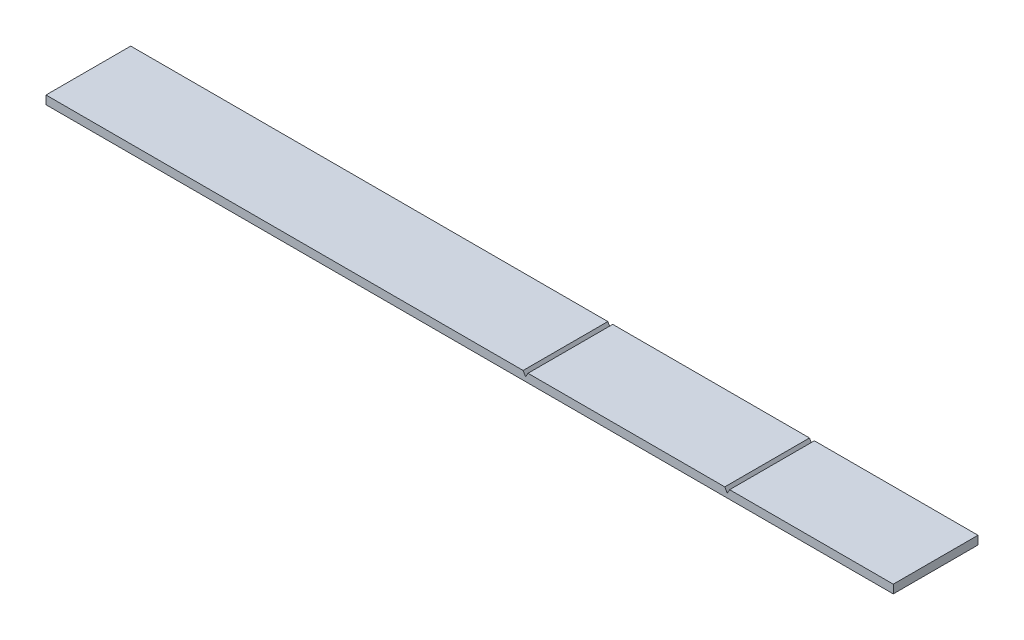
ISO-10303-21;
HEADER;
FILE_DESCRIPTION(('STEP AP214'),'2;1');
FILE_NAME('part.step','',(''),(''),'','','');
FILE_SCHEMA(('AUTOMOTIVE_DESIGN { 1 0 10303 214 1 1 1 1 }'));
ENDSEC;
DATA;
#1=APPLICATION_CONTEXT('core data for automotive mechanical design processes');
#2=APPLICATION_PROTOCOL_DEFINITION('international standard','automotive_design',2000,#1);
#3=PRODUCT_CONTEXT('',#1,'mechanical');
#4=PRODUCT('Part','Part','',(#3));
#5=PRODUCT_RELATED_PRODUCT_CATEGORY('part','',(#4));
#6=PRODUCT_DEFINITION_FORMATION('','',#4);
#7=PRODUCT_DEFINITION_CONTEXT('part definition',#1,'design');
#8=PRODUCT_DEFINITION('design','',#6,#7);
#9=PRODUCT_DEFINITION_SHAPE('','',#8);
#10=(LENGTH_UNIT() NAMED_UNIT(*) SI_UNIT(.MILLI.,.METRE.));
#11=(NAMED_UNIT(*) PLANE_ANGLE_UNIT() SI_UNIT($,.RADIAN.));
#12=(NAMED_UNIT(*) SI_UNIT($,.STERADIAN.) SOLID_ANGLE_UNIT());
#13=UNCERTAINTY_MEASURE_WITH_UNIT(LENGTH_MEASURE(1.E-05),#10,'distance_accuracy_value','');
#14=(GEOMETRIC_REPRESENTATION_CONTEXT(3) GLOBAL_UNCERTAINTY_ASSIGNED_CONTEXT((#13)) GLOBAL_UNIT_ASSIGNED_CONTEXT((#10,
#11,#12)) REPRESENTATION_CONTEXT('',''));
#15=CARTESIAN_POINT('',(0.,0.,0.));
#16=DIRECTION('',(0.,0.,1.));
#17=DIRECTION('',(1.,0.,0.));
#18=AXIS2_PLACEMENT_3D('',#15,#16,#17);
#19=CARTESIAN_POINT('',(0.,0.,100.));
#20=DIRECTION('',(1.,0.,0.));
#21=DIRECTION('',(0.,1.,0.));
#22=AXIS2_PLACEMENT_3D('',#19,#20,#21);
#23=PLANE('',#22);
#24=DIRECTION('',(0.,-1.,0.));
#25=VECTOR('',#24,1.);
#26=CARTESIAN_POINT('',(0.,0.,0.));
#27=LINE('',#26,#25);
#28=CARTESIAN_POINT('',(0.,0.,0.));
#29=VERTEX_POINT('',#28);
#30=CARTESIAN_POINT('',(0.,-10.,0.));
#31=VERTEX_POINT('',#30);
#32=EDGE_CURVE('E154',#29,#31,#27,.T.);
#33=ORIENTED_EDGE('',*,*,#32,.T.);
#34=DIRECTION('',(0.,0.,-1.));
#35=VECTOR('',#34,1.);
#36=CARTESIAN_POINT('',(0.,-10.,100.));
#37=LINE('',#36,#35);
#38=CARTESIAN_POINT('',(0.,-10.,100.));
#39=VERTEX_POINT('',#38);
#40=EDGE_CURVE('E11',#39,#31,#37,.T.);
#41=ORIENTED_EDGE('',*,*,#40,.F.);
#42=DIRECTION('',(0.,-1.,0.));
#43=VECTOR('',#42,1.);
#44=CARTESIAN_POINT('',(0.,0.,100.));
#45=LINE('',#44,#43);
#46=CARTESIAN_POINT('',(0.,0.,100.));
#47=VERTEX_POINT('',#46);
#48=EDGE_CURVE('E182',#47,#39,#45,.T.);
#49=ORIENTED_EDGE('',*,*,#48,.F.);
#50=DIRECTION('',(0.,0.,-1.));
#51=VECTOR('',#50,1.);
#52=CARTESIAN_POINT('',(0.,0.,100.));
#53=LINE('',#52,#51);
#54=EDGE_CURVE('E150',#47,#29,#53,.T.);
#55=ORIENTED_EDGE('',*,*,#54,.T.);
#56=EDGE_LOOP('',(#33,#41,#49,#55));
#57=FACE_BOUND('',#56,.T.);
#58=ADVANCED_FACE('F41',(#57),#23,.F.);
#59=CARTESIAN_POINT('',(0.,-10.,100.));
#60=DIRECTION('',(0.,1.,0.));
#61=DIRECTION('',(-1.,0.,0.));
#62=AXIS2_PLACEMENT_3D('',#59,#60,#61);
#63=PLANE('',#62);
#64=DIRECTION('',(1.,0.,0.));
#65=VECTOR('',#64,1.);
#66=CARTESIAN_POINT('',(0.,-10.,0.));
#67=LINE('',#66,#65);
#68=CARTESIAN_POINT('',(1000.,-10.,0.));
#69=VERTEX_POINT('',#68);
#70=EDGE_CURVE('E158',#31,#69,#67,.T.);
#71=ORIENTED_EDGE('',*,*,#70,.T.);
#72=DIRECTION('',(0.,0.,-1.));
#73=VECTOR('',#72,1.);
#74=CARTESIAN_POINT('',(1000.,-10.,100.));
#75=LINE('',#74,#73);
#76=CARTESIAN_POINT('',(1000.,-10.,100.));
#77=VERTEX_POINT('',#76);
#78=EDGE_CURVE('E50',#77,#69,#75,.T.);
#79=ORIENTED_EDGE('',*,*,#78,.F.);
#80=DIRECTION('',(1.,0.,0.));
#81=VECTOR('',#80,1.);
#82=CARTESIAN_POINT('',(0.,-10.,100.));
#83=LINE('',#82,#81);
#84=EDGE_CURVE('E107',#39,#77,#83,.T.);
#85=ORIENTED_EDGE('',*,*,#84,.F.);
#86=ORIENTED_EDGE('',*,*,#40,.T.);
#87=EDGE_LOOP('',(#71,#79,#85,#86));
#88=FACE_BOUND('',#87,.T.);
#89=ADVANCED_FACE('F246',(#88),#63,.F.);
#90=CARTESIAN_POINT('',(1000.,0.,100.));
#91=DIRECTION('',(-1.,0.,0.));
#92=DIRECTION('',(0.,0.,1.));
#93=AXIS2_PLACEMENT_3D('',#90,#91,#92);
#94=PLANE('',#93);
#95=DIRECTION('',(0.,1.,0.));
#96=VECTOR('',#95,1.);
#97=CARTESIAN_POINT('',(1000.,0.,0.));
#98=LINE('',#97,#96);
#99=CARTESIAN_POINT('',(1000.,0.,0.));
#100=VERTEX_POINT('',#99);
#101=EDGE_CURVE('E161',#69,#100,#98,.T.);
#102=ORIENTED_EDGE('',*,*,#101,.T.);
#103=DIRECTION('',(0.,0.,-1.));
#104=VECTOR('',#103,1.);
#105=CARTESIAN_POINT('',(1000.,0.,100.));
#106=LINE('',#105,#104);
#107=CARTESIAN_POINT('',(1000.,0.,100.));
#108=VERTEX_POINT('',#107);
#109=EDGE_CURVE('E201',#108,#100,#106,.T.);
#110=ORIENTED_EDGE('',*,*,#109,.F.);
#111=DIRECTION('',(0.,1.,0.));
#112=VECTOR('',#111,1.);
#113=CARTESIAN_POINT('',(1000.,0.,100.));
#114=LINE('',#113,#112);
#115=EDGE_CURVE('E211',#77,#108,#114,.T.);
#116=ORIENTED_EDGE('',*,*,#115,.F.);
#117=ORIENTED_EDGE('',*,*,#78,.T.);
#118=EDGE_LOOP('',(#102,#110,#116,#117));
#119=FACE_BOUND('',#118,.T.);
#120=ADVANCED_FACE('F209',(#119),#94,.F.);
#121=CARTESIAN_POINT('',(806.886751345948,0.,100.));
#122=DIRECTION('',(0.,-1.,0.));
#123=DIRECTION('',(0.,0.,-1.));
#124=AXIS2_PLACEMENT_3D('',#121,#122,#123);
#125=PLANE('',#124);
#126=DIRECTION('',(-1.,0.,0.));
#127=VECTOR('',#126,1.);
#128=CARTESIAN_POINT('',(806.886751345948,0.,0.));
#129=LINE('',#128,#127);
#130=CARTESIAN_POINT('',(806.886751345948,0.,0.));
#131=VERTEX_POINT('',#130);
#132=EDGE_CURVE('E164',#100,#131,#129,.T.);
#133=ORIENTED_EDGE('',*,*,#132,.T.);
#134=DIRECTION('',(0.,0.,-1.));
#135=VECTOR('',#134,1.);
#136=CARTESIAN_POINT('',(806.886751345948,0.,100.));
#137=LINE('',#136,#135);
#138=CARTESIAN_POINT('',(806.886751345948,0.,100.));
#139=VERTEX_POINT('',#138);
#140=EDGE_CURVE('E197',#139,#131,#137,.T.);
#141=ORIENTED_EDGE('',*,*,#140,.F.);
#142=DIRECTION('',(-1.,0.,0.));
#143=VECTOR('',#142,1.);
#144=CARTESIAN_POINT('',(806.886751345948,0.,100.));
#145=LINE('',#144,#143);
#146=EDGE_CURVE('E230',#108,#139,#145,.T.);
#147=ORIENTED_EDGE('',*,*,#146,.F.);
#148=ORIENTED_EDGE('',*,*,#109,.T.);
#149=EDGE_LOOP('',(#133,#141,#147,#148));
#150=FACE_BOUND('',#149,.T.);
#151=ADVANCED_FACE('F220',(#150),#125,.F.);
#152=CARTESIAN_POINT('',(804.,-5.,100.));
#153=DIRECTION('',(0.866025403784443,-0.499999999999992,0.));
#154=DIRECTION('',(0.499999999999992,0.866025403784443,0.));
#155=AXIS2_PLACEMENT_3D('',#152,#153,#154);
#156=PLANE('',#155);
#157=DIRECTION('',(-0.499999999999992,-0.866025403784443,0.));
#158=VECTOR('',#157,1.);
#159=CARTESIAN_POINT('',(804.,-5.,0.));
#160=LINE('',#159,#158);
#161=CARTESIAN_POINT('',(804.,-5.,0.));
#162=VERTEX_POINT('',#161);
#163=EDGE_CURVE('E167',#131,#162,#160,.T.);
#164=ORIENTED_EDGE('',*,*,#163,.T.);
#165=DIRECTION('',(0.,0.,-1.));
#166=VECTOR('',#165,1.);
#167=CARTESIAN_POINT('',(804.,-5.,100.));
#168=LINE('',#167,#166);
#169=CARTESIAN_POINT('',(804.,-5.,100.));
#170=VERTEX_POINT('',#169);
#171=EDGE_CURVE('E193',#170,#162,#168,.T.);
#172=ORIENTED_EDGE('',*,*,#171,.F.);
#173=DIRECTION('',(-0.499999999999992,-0.866025403784443,0.));
#174=VECTOR('',#173,1.);
#175=CARTESIAN_POINT('',(804.,-5.,100.));
#176=LINE('',#175,#174);
#177=EDGE_CURVE('E226',#139,#170,#176,.T.);
#178=ORIENTED_EDGE('',*,*,#177,.F.);
#179=ORIENTED_EDGE('',*,*,#140,.T.);
#180=EDGE_LOOP('',(#164,#172,#178,#179));
#181=FACE_BOUND('',#180,.T.);
#182=ADVANCED_FACE('F224',(#181),#156,.F.);
#183=CARTESIAN_POINT('',(801.113248654052,0.,100.));
#184=DIRECTION('',(-0.866025403784435,-0.500000000000007,0.));
#185=DIRECTION('',(0.500000000000007,-0.866025403784435,0.));
#186=AXIS2_PLACEMENT_3D('',#183,#184,#185);
#187=PLANE('',#186);
#188=DIRECTION('',(-0.500000000000007,0.866025403784435,0.));
#189=VECTOR('',#188,1.);
#190=CARTESIAN_POINT('',(801.113248654052,0.,0.));
#191=LINE('',#190,#189);
#192=CARTESIAN_POINT('',(801.113248654052,0.,0.));
#193=VERTEX_POINT('',#192);
#194=EDGE_CURVE('E170',#162,#193,#191,.T.);
#195=ORIENTED_EDGE('',*,*,#194,.T.);
#196=DIRECTION('',(0.,0.,-1.));
#197=VECTOR('',#196,1.);
#198=CARTESIAN_POINT('',(801.113248654052,0.,100.));
#199=LINE('',#198,#197);
#200=CARTESIAN_POINT('',(801.113248654052,0.,100.));
#201=VERTEX_POINT('',#200);
#202=EDGE_CURVE('E189',#201,#193,#199,.T.);
#203=ORIENTED_EDGE('',*,*,#202,.F.);
#204=DIRECTION('',(-0.500000000000007,0.866025403784435,0.));
#205=VECTOR('',#204,1.);
#206=CARTESIAN_POINT('',(801.113248654052,0.,100.));
#207=LINE('',#206,#205);
#208=EDGE_CURVE('E229',#170,#201,#207,.T.);
#209=ORIENTED_EDGE('',*,*,#208,.F.);
#210=ORIENTED_EDGE('',*,*,#171,.T.);
#211=EDGE_LOOP('',(#195,#203,#209,#210));
#212=FACE_BOUND('',#211,.T.);
#213=ADVANCED_FACE('F258',(#212),#187,.F.);
#214=CARTESIAN_POINT('',(568.886751345948,0.,100.));
#215=DIRECTION('',(0.,-1.,0.));
#216=DIRECTION('',(0.,0.,-1.));
#217=AXIS2_PLACEMENT_3D('',#214,#215,#216);
#218=PLANE('',#217);
#219=DIRECTION('',(-1.,0.,0.));
#220=VECTOR('',#219,1.);
#221=CARTESIAN_POINT('',(568.886751345948,0.,0.));
#222=LINE('',#221,#220);
#223=CARTESIAN_POINT('',(568.886751345948,0.,0.));
#224=VERTEX_POINT('',#223);
#225=EDGE_CURVE('E173',#193,#224,#222,.T.);
#226=ORIENTED_EDGE('',*,*,#225,.T.);
#227=DIRECTION('',(0.,0.,-1.));
#228=VECTOR('',#227,1.);
#229=CARTESIAN_POINT('',(568.886751345948,0.,100.));
#230=LINE('',#229,#228);
#231=CARTESIAN_POINT('',(568.886751345948,0.,100.));
#232=VERTEX_POINT('',#231);
#233=EDGE_CURVE('E143',#232,#224,#230,.T.);
#234=ORIENTED_EDGE('',*,*,#233,.F.);
#235=DIRECTION('',(-1.,0.,0.));
#236=VECTOR('',#235,1.);
#237=CARTESIAN_POINT('',(568.886751345948,0.,100.));
#238=LINE('',#237,#236);
#239=EDGE_CURVE('E132',#201,#232,#238,.T.);
#240=ORIENTED_EDGE('',*,*,#239,.F.);
#241=ORIENTED_EDGE('',*,*,#202,.T.);
#242=EDGE_LOOP('',(#226,#234,#240,#241));
#243=FACE_BOUND('',#242,.T.);
#244=ADVANCED_FACE('F261',(#243),#218,.F.);
#245=CARTESIAN_POINT('',(566.,-5.,100.));
#246=DIRECTION('',(0.866025403784443,-0.499999999999992,0.));
#247=DIRECTION('',(0.499999999999992,0.866025403784443,0.));
#248=AXIS2_PLACEMENT_3D('',#245,#246,#247);
#249=PLANE('',#248);
#250=DIRECTION('',(-0.499999999999992,-0.866025403784443,0.));
#251=VECTOR('',#250,1.);
#252=CARTESIAN_POINT('',(566.,-5.,0.));
#253=LINE('',#252,#251);
#254=CARTESIAN_POINT('',(566.,-5.,0.));
#255=VERTEX_POINT('',#254);
#256=EDGE_CURVE('E141',#224,#255,#253,.T.);
#257=ORIENTED_EDGE('',*,*,#256,.T.);
#258=DIRECTION('',(0.,0.,-1.));
#259=VECTOR('',#258,1.);
#260=CARTESIAN_POINT('',(566.,-5.,100.));
#261=LINE('',#260,#259);
#262=CARTESIAN_POINT('',(566.,-5.,100.));
#263=VERTEX_POINT('',#262);
#264=EDGE_CURVE('E138',#263,#255,#261,.T.);
#265=ORIENTED_EDGE('',*,*,#264,.F.);
#266=DIRECTION('',(-0.499999999999992,-0.866025403784443,0.));
#267=VECTOR('',#266,1.);
#268=CARTESIAN_POINT('',(566.,-5.,100.));
#269=LINE('',#268,#267);
#270=EDGE_CURVE('E126',#232,#263,#269,.T.);
#271=ORIENTED_EDGE('',*,*,#270,.F.);
#272=ORIENTED_EDGE('',*,*,#233,.T.);
#273=EDGE_LOOP('',(#257,#265,#271,#272));
#274=FACE_BOUND('',#273,.T.);
#275=ADVANCED_FACE('F139',(#274),#249,.F.);
#276=CARTESIAN_POINT('',(563.113248654052,0.,100.));
#277=DIRECTION('',(-0.866025403784443,-0.499999999999992,0.));
#278=DIRECTION('',(0.499999999999992,-0.866025403784443,0.));
#279=AXIS2_PLACEMENT_3D('',#276,#277,#278);
#280=PLANE('',#279);
#281=DIRECTION('',(-0.499999999999992,0.866025403784443,0.));
#282=VECTOR('',#281,1.);
#283=CARTESIAN_POINT('',(563.113248654052,0.,0.));
#284=LINE('',#283,#282);
#285=CARTESIAN_POINT('',(563.113248654052,0.,0.));
#286=VERTEX_POINT('',#285);
#287=EDGE_CURVE('E93',#255,#286,#284,.T.);
#288=ORIENTED_EDGE('',*,*,#287,.T.);
#289=DIRECTION('',(0.,0.,-1.));
#290=VECTOR('',#289,1.);
#291=CARTESIAN_POINT('',(563.113248654052,0.,100.));
#292=LINE('',#291,#290);
#293=CARTESIAN_POINT('',(563.113248654052,0.,100.));
#294=VERTEX_POINT('',#293);
#295=EDGE_CURVE('E144',#294,#286,#292,.T.);
#296=ORIENTED_EDGE('',*,*,#295,.F.);
#297=DIRECTION('',(-0.499999999999992,0.866025403784443,0.));
#298=VECTOR('',#297,1.);
#299=CARTESIAN_POINT('',(563.113248654052,0.,100.));
#300=LINE('',#299,#298);
#301=EDGE_CURVE('E130',#263,#294,#300,.T.);
#302=ORIENTED_EDGE('',*,*,#301,.F.);
#303=ORIENTED_EDGE('',*,*,#264,.T.);
#304=EDGE_LOOP('',(#288,#296,#302,#303));
#305=FACE_BOUND('',#304,.T.);
#306=ADVANCED_FACE('F146',(#305),#280,.F.);
#307=CARTESIAN_POINT('',(0.,0.,100.));
#308=DIRECTION('',(0.,-1.,0.));
#309=DIRECTION('',(0.,0.,-1.));
#310=AXIS2_PLACEMENT_3D('',#307,#308,#309);
#311=PLANE('',#310);
#312=DIRECTION('',(-1.,0.,0.));
#313=VECTOR('',#312,1.);
#314=CARTESIAN_POINT('',(0.,0.,0.));
#315=LINE('',#314,#313);
#316=EDGE_CURVE('E99',#286,#29,#315,.T.);
#317=ORIENTED_EDGE('',*,*,#316,.T.);
#318=ORIENTED_EDGE('',*,*,#54,.F.);
#319=DIRECTION('',(-1.,0.,0.));
#320=VECTOR('',#319,1.);
#321=CARTESIAN_POINT('',(0.,0.,100.));
#322=LINE('',#321,#320);
#323=EDGE_CURVE('E58',#294,#47,#322,.T.);
#324=ORIENTED_EDGE('',*,*,#323,.F.);
#325=ORIENTED_EDGE('',*,*,#295,.T.);
#326=EDGE_LOOP('',(#317,#318,#324,#325));
#327=FACE_BOUND('',#326,.T.);
#328=ADVANCED_FACE('F270',(#327),#311,.F.);
#329=CARTESIAN_POINT('',(0.,0.,100.));
#330=DIRECTION('',(0.,0.,1.));
#331=DIRECTION('',(1.,0.,0.));
#332=AXIS2_PLACEMENT_3D('',#329,#330,#331);
#333=PLANE('',#332);
#334=ORIENTED_EDGE('',*,*,#48,.T.);
#335=ORIENTED_EDGE('',*,*,#84,.T.);
#336=ORIENTED_EDGE('',*,*,#115,.T.);
#337=ORIENTED_EDGE('',*,*,#146,.T.);
#338=ORIENTED_EDGE('',*,*,#177,.T.);
#339=ORIENTED_EDGE('',*,*,#208,.T.);
#340=ORIENTED_EDGE('',*,*,#239,.T.);
#341=ORIENTED_EDGE('',*,*,#270,.T.);
#342=ORIENTED_EDGE('',*,*,#301,.T.);
#343=ORIENTED_EDGE('',*,*,#323,.T.);
#344=EDGE_LOOP('',(#334,#335,#336,#337,#338,#339,#340,#341,#342,#343));
#345=FACE_BOUND('',#344,.T.);
#346=ADVANCED_FACE('F128',(#345),#333,.T.);
#347=CARTESIAN_POINT('',(0.,0.,0.));
#348=DIRECTION('',(0.,0.,1.));
#349=DIRECTION('',(1.,0.,0.));
#350=AXIS2_PLACEMENT_3D('',#347,#348,#349);
#351=PLANE('',#350);
#352=ORIENTED_EDGE('',*,*,#32,.F.);
#353=ORIENTED_EDGE('',*,*,#316,.F.);
#354=ORIENTED_EDGE('',*,*,#287,.F.);
#355=ORIENTED_EDGE('',*,*,#256,.F.);
#356=ORIENTED_EDGE('',*,*,#225,.F.);
#357=ORIENTED_EDGE('',*,*,#194,.F.);
#358=ORIENTED_EDGE('',*,*,#163,.F.);
#359=ORIENTED_EDGE('',*,*,#132,.F.);
#360=ORIENTED_EDGE('',*,*,#101,.F.);
#361=ORIENTED_EDGE('',*,*,#70,.F.);
#362=EDGE_LOOP('',(#352,#353,#354,#355,#356,#357,#358,#359,#360,#361));
#363=FACE_BOUND('',#362,.T.);
#364=ADVANCED_FACE('F215',(#363),#351,.F.);
#365=CLOSED_SHELL('',(#58,#89,#120,#151,#182,#213,#244,#275,#306,#328,#346,#364));
#366=MANIFOLD_SOLID_BREP('B2',#365);
#367=ADVANCED_BREP_SHAPE_REPRESENTATION('',(#18,#366),#14);
#368=SHAPE_DEFINITION_REPRESENTATION(#9,#367);
ENDSEC;
END-ISO-10303-21;
